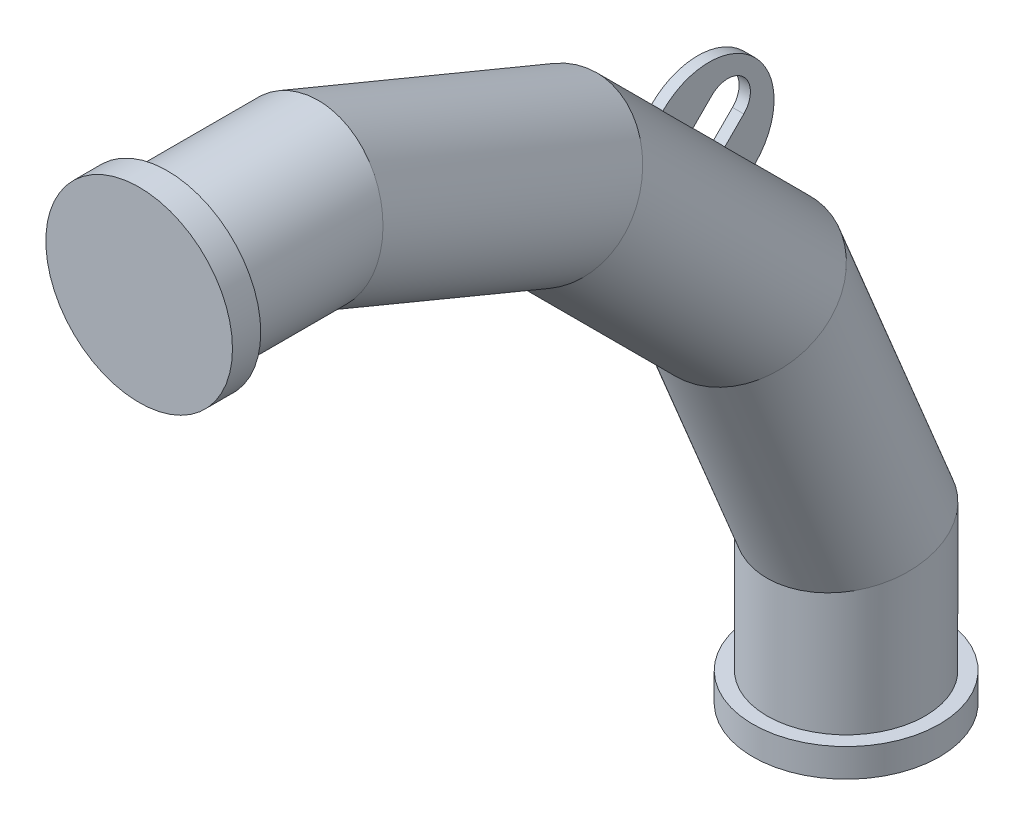
ISO-10303-21;
HEADER;
FILE_DESCRIPTION(('STEP AP214'),'2;1');
FILE_NAME('part.step','',(''),(''),'','','');
FILE_SCHEMA(('AUTOMOTIVE_DESIGN { 1 0 10303 214 1 1 1 1 }'));
ENDSEC;
DATA;
#1=APPLICATION_CONTEXT('core data for automotive mechanical design processes');
#2=APPLICATION_PROTOCOL_DEFINITION('international standard','automotive_design',2000,#1);
#3=PRODUCT_CONTEXT('',#1,'mechanical');
#4=PRODUCT('Part','Part','',(#3));
#5=PRODUCT_RELATED_PRODUCT_CATEGORY('part','',(#4));
#6=PRODUCT_DEFINITION_FORMATION('','',#4);
#7=PRODUCT_DEFINITION_CONTEXT('part definition',#1,'design');
#8=PRODUCT_DEFINITION('design','',#6,#7);
#9=PRODUCT_DEFINITION_SHAPE('','',#8);
#10=(LENGTH_UNIT() NAMED_UNIT(*) SI_UNIT(.MILLI.,.METRE.));
#11=(NAMED_UNIT(*) PLANE_ANGLE_UNIT() SI_UNIT($,.RADIAN.));
#12=(NAMED_UNIT(*) SI_UNIT($,.STERADIAN.) SOLID_ANGLE_UNIT());
#13=UNCERTAINTY_MEASURE_WITH_UNIT(LENGTH_MEASURE(1.E-05),#10,'distance_accuracy_value','');
#14=(GEOMETRIC_REPRESENTATION_CONTEXT(3) GLOBAL_UNCERTAINTY_ASSIGNED_CONTEXT((#13)) GLOBAL_UNIT_ASSIGNED_CONTEXT((#10,
#11,#12)) REPRESENTATION_CONTEXT('',''));
#15=CARTESIAN_POINT('',(0.,0.,0.));
#16=DIRECTION('',(0.,0.,1.));
#17=DIRECTION('',(1.,0.,0.));
#18=AXIS2_PLACEMENT_3D('',#15,#16,#17);
#19=CARTESIAN_POINT('',(0.,0.,0.));
#20=DIRECTION('',(0.,0.,0.999999999999917));
#21=DIRECTION('',(1.00000000000005,0.,0.));
#22=AXIS2_PLACEMENT_3D('',#19,#20,#21);
#23=PLANE('',#22);
#24=CARTESIAN_POINT('',(0.,0.,0.));
#25=DIRECTION('',(0.,0.,0.999999999999917));
#26=DIRECTION('',(1.00000000000005,0.,0.));
#27=AXIS2_PLACEMENT_3D('',#24,#25,#26);
#28=CIRCLE('',#27,82.5);
#29=CARTESIAN_POINT('',(82.5000000000045,-8.3956889418988E-13,-2.91044771522028E-13));
#30=VERTEX_POINT('',#29);
#31=EDGE_CURVE('E20',#30,#30,#28,.T.);
#32=ORIENTED_EDGE('',*,*,#31,.T.);
#33=EDGE_LOOP('',(#32));
#34=FACE_BOUND('',#33,.T.);
#35=ADVANCED_FACE('F16',(#34),#23,.T.);
#36=CARTESIAN_POINT('',(-4.2632564145606E-11,1.59872115546023E-11,-24.9999999999986));
#37=DIRECTION('',(0.,0.,0.999999999999917));
#38=DIRECTION('',(1.00000000000005,0.,0.));
#39=AXIS2_PLACEMENT_3D('',#36,#37,#38);
#40=CYLINDRICAL_SURFACE('',#39,82.5);
#41=CARTESIAN_POINT('',(-4.2632564145606E-11,1.59872115546023E-11,-24.9999999999986));
#42=DIRECTION('',(0.,0.,0.999999999999917));
#43=DIRECTION('',(1.00000000000005,0.,0.));
#44=AXIS2_PLACEMENT_3D('',#41,#42,#43);
#45=CIRCLE('',#44,82.5);
#46=CARTESIAN_POINT('',(82.4999999999618,1.51476426604124E-11,-24.9999999999989));
#47=VERTEX_POINT('',#46);
#48=EDGE_CURVE('E27',#47,#47,#45,.T.);
#49=ORIENTED_EDGE('',*,*,#48,.T.);
#50=EDGE_LOOP('',(#49));
#51=FACE_BOUND('',#50,.T.);
#52=ORIENTED_EDGE('',*,*,#31,.F.);
#53=EDGE_LOOP('',(#52));
#54=FACE_BOUND('',#53,.T.);
#55=ADVANCED_FACE('F18',(#51,#54),#40,.T.);
#56=CARTESIAN_POINT('',(-4.2632564145606E-11,1.59872115546023E-11,-24.9999999999986));
#57=DIRECTION('',(0.,0.,0.999999999999917));
#58=DIRECTION('',(1.00000000000005,0.,0.));
#59=AXIS2_PLACEMENT_3D('',#56,#57,#58);
#60=PLANE('',#59);
#61=CARTESIAN_POINT('',(2.82424585789659E-13,-3.80894403837855E-13,-24.9999999999987));
#62=DIRECTION('',(0.,0.,-0.99999999999992));
#63=DIRECTION('',(0.,0.999999999999963,0.));
#64=AXIS2_PLACEMENT_3D('',#61,#62,#63);
#65=CIRCLE('',#64,69.85);
#66=CARTESIAN_POINT('',(8.83549409532471E-13,69.849999999997,-24.9999999999983));
#67=VERTEX_POINT('',#66);
#68=EDGE_CURVE('E10',#67,#67,#65,.T.);
#69=ORIENTED_EDGE('',*,*,#68,.F.);
#70=EDGE_LOOP('',(#69));
#71=FACE_BOUND('',#70,.T.);
#72=ORIENTED_EDGE('',*,*,#48,.F.);
#73=EDGE_LOOP('',(#72));
#74=FACE_BOUND('',#73,.T.);
#75=ADVANCED_FACE('F313',(#71,#74),#60,.F.);
#76=CARTESIAN_POINT('',(5.9977401324112E-12,-260.127301589902,-533.655439013424));
#77=DIRECTION('',(0.,0.707106781186513,0.707106781186446));
#78=DIRECTION('',(0.,-0.707106781186533,0.707106781186462));
#79=AXIS2_PLACEMENT_3D('',#76,#77,#78);
#80=CYLINDRICAL_SURFACE('',#79,69.85);
#81=CARTESIAN_POINT('',(4.01236839414371E-12,-189.878066911988,-463.406204335516));
#82=DIRECTION('',(0.,-0.707106781186528,-0.707106781186567));
#83=DIRECTION('',(0.,0.707106781186567,-0.707106781186528));
#84=AXIS2_PLACEMENT_3D('',#81,#82,#83);
#85=CIRCLE('',#84,69.85);
#86=CARTESIAN_POINT('',(-5.00000000000099,-140.613360985747,-512.670910261768));
#87=VERTEX_POINT('',#86);
#88=CARTESIAN_POINT('',(4.99999999999901,-140.613360985746,-512.670910261768));
#89=VERTEX_POINT('',#88);
#90=EDGE_CURVE('E287',#87,#89,#85,.T.);
#91=ORIENTED_EDGE('',*,*,#90,.F.);
#92=DIRECTION('',(0.,0.707106781186513,0.707106781186446));
#93=VECTOR('',#92,1.);
#94=CARTESIAN_POINT('',(-5.,-210.862595663658,-582.920144939672));
#95=LINE('',#94,#93);
#96=CARTESIAN_POINT('',(-5.,-167.129865280232,-539.18741455626));
#97=VERTEX_POINT('',#96);
#98=EDGE_CURVE('E280',#97,#87,#95,.T.);
#99=ORIENTED_EDGE('',*,*,#98,.F.);
#100=CARTESIAN_POINT('',(4.76177325905526E-12,-216.394571206485,-489.922708630011));
#101=DIRECTION('',(0.,0.707106781186528,0.707106781186567));
#102=DIRECTION('',(0.,-0.707106781186567,0.707106781186528));
#103=AXIS2_PLACEMENT_3D('',#100,#101,#102);
#104=CIRCLE('',#103,69.85);
#105=CARTESIAN_POINT('',(5.,-167.129865280232,-539.187414556261));
#106=VERTEX_POINT('',#105);
#107=EDGE_CURVE('E276',#106,#97,#104,.T.);
#108=ORIENTED_EDGE('',*,*,#107,.F.);
#109=DIRECTION('',(0.,0.707106781186513,0.707106781186446));
#110=VECTOR('',#109,1.);
#111=CARTESIAN_POINT('',(5.,-210.862595663658,-582.920144939673));
#112=LINE('',#111,#110);
#113=EDGE_CURVE('E284',#106,#89,#112,.T.);
#114=ORIENTED_EDGE('',*,*,#113,.T.);
#115=EDGE_LOOP('',(#91,#99,#108,#114));
#116=FACE_BOUND('',#115,.T.);
#117=CARTESIAN_POINT('',(-3.52762477943871E-12,-260.127301589742,-533.655439013625));
#118=DIRECTION('',(0.,0.831469612302445,0.555570233019576));
#119=DIRECTION('',(0.,-0.555570233019497,0.8314696123025));
#120=AXIS2_PLACEMENT_3D('',#117,#118,#119);
#121=ELLIPSE('',#120,71.218442400851,69.85);
#122=CARTESIAN_POINT('',(-2.74032078247067E-12,-299.694148229668,-474.439468321801));
#123=VERTEX_POINT('',#122);
#124=EDGE_CURVE('E265',#123,#123,#121,.T.);
#125=ORIENTED_EDGE('',*,*,#124,.T.);
#126=EDGE_LOOP('',(#125));
#127=FACE_BOUND('',#126,.T.);
#128=CARTESIAN_POINT('',(-7.7047274067435E-11,-91.3445609866423,-364.872698410153));
#129=DIRECTION('',(0.,0.555570233019575,0.831469612302437));
#130=DIRECTION('',(0.,0.831469612302526,-0.555570233019533));
#131=AXIS2_PLACEMENT_3D('',#128,#129,#130);
#132=ELLIPSE('',#131,71.218442400851,69.85);
#133=CARTESIAN_POINT('',(-7.68251839981912E-11,-32.128590294817,-404.439545050082));
#134=VERTEX_POINT('',#133);
#135=EDGE_CURVE('E261',#134,#134,#132,.T.);
#136=ORIENTED_EDGE('',*,*,#135,.F.);
#137=EDGE_LOOP('',(#136));
#138=FACE_BOUND('',#137,.T.);
#139=CARTESIAN_POINT('',(3.21300320490472E-12,-161.593795664524,-435.121933088056));
#140=DIRECTION('',(0.,0.707106781186528,0.707106781186567));
#141=DIRECTION('',(0.,-0.707106781186567,0.707106781186528));
#142=AXIS2_PLACEMENT_3D('',#139,#140,#141);
#143=CIRCLE('',#142,69.85);
#144=CARTESIAN_POINT('',(4.99999999999861,-112.329089738286,-484.38663901431));
#145=VERTEX_POINT('',#144);
#146=CARTESIAN_POINT('',(-5.00000000000139,-112.329089738286,-484.38663901431));
#147=VERTEX_POINT('',#146);
#148=EDGE_CURVE('E40',#145,#147,#143,.T.);
#149=ORIENTED_EDGE('',*,*,#148,.F.);
#150=CARTESIAN_POINT('',(5.,-85.812585443775,-457.870134719811));
#151=VERTEX_POINT('',#150);
#152=EDGE_CURVE('E288',#145,#151,#112,.T.);
#153=ORIENTED_EDGE('',*,*,#152,.T.);
#154=CARTESIAN_POINT('',(2.46359833999317E-12,-135.077291370028,-408.605428793562));
#155=DIRECTION('',(0.,-0.707106781186528,-0.707106781186567));
#156=DIRECTION('',(0.,0.707106781186567,-0.707106781186528));
#157=AXIS2_PLACEMENT_3D('',#154,#155,#156);
#158=CIRCLE('',#157,69.85);
#159=CARTESIAN_POINT('',(-5.,-85.8125854437753,-457.870134719811));
#160=VERTEX_POINT('',#159);
#161=EDGE_CURVE('E292',#160,#151,#158,.T.);
#162=ORIENTED_EDGE('',*,*,#161,.F.);
#163=EDGE_CURVE('E49',#147,#160,#95,.T.);
#164=ORIENTED_EDGE('',*,*,#163,.F.);
#165=EDGE_LOOP('',(#149,#153,#162,#164));
#166=FACE_BOUND('',#165,.T.);
#167=ADVANCED_FACE('F319',(#116,#127,#138,#166),#80,.T.);
#168=CARTESIAN_POINT('',(8.79509533044249E-11,-480.65257957233,-625.000000000124));
#169=DIRECTION('',(0.,-0.99999999999992,0.));
#170=DIRECTION('',(0.,0.,0.999999999999963));
#171=AXIS2_PLACEMENT_3D('',#168,#169,#170);
#172=CYLINDRICAL_SURFACE('',#171,69.85);
#173=CARTESIAN_POINT('',(3.13609077507339E-12,-600.000000000038,-625.000000000063));
#174=DIRECTION('',(0.,0.99999999999992,0.));
#175=DIRECTION('',(0.,0.,-0.999999999999963));
#176=AXIS2_PLACEMENT_3D('',#173,#174,#175);
#177=CIRCLE('',#176,69.85);
#178=CARTESIAN_POINT('',(2.52333358959007E-12,-600.000000000039,-694.85000000006));
#179=VERTEX_POINT('',#178);
#180=EDGE_CURVE('E253',#179,#179,#177,.T.);
#181=ORIENTED_EDGE('',*,*,#180,.T.);
#182=EDGE_LOOP('',(#181));
#183=FACE_BOUND('',#182,.T.);
#184=CARTESIAN_POINT('',(8.79509533044249E-11,-480.65257957233,-625.000000000124));
#185=DIRECTION('',(0.,0.980785280403154,0.195090322016123));
#186=DIRECTION('',(0.,-0.195090322016098,0.980785280403191));
#187=AXIS2_PLACEMENT_3D('',#184,#185,#186);
#188=ELLIPSE('',#187,71.218442400851,69.85);
#189=CARTESIAN_POINT('',(8.87704458832899E-11,-494.546608433797,-555.150000000127));
#190=VERTEX_POINT('',#189);
#191=EDGE_CURVE('E269',#190,#190,#188,.T.);
#192=ORIENTED_EDGE('',*,*,#191,.F.);
#193=EDGE_LOOP('',(#192));
#194=FACE_BOUND('',#193,.T.);
#195=ADVANCED_FACE('F325',(#183,#194),#172,.T.);
#196=CARTESIAN_POINT('',(-3.52762477943871E-12,-260.127301589742,-533.655439013625));
#197=DIRECTION('',(0.,-0.923879532511181,-0.382683432365094));
#198=DIRECTION('',(0.,-0.382683432365013,0.923879532511242));
#199=AXIS2_PLACEMENT_3D('',#196,#197,#198);
#200=CYLINDRICAL_SURFACE('',#199,69.85);
#201=ORIENTED_EDGE('',*,*,#124,.F.);
#202=EDGE_LOOP('',(#201));
#203=FACE_BOUND('',#202,.T.);
#204=ORIENTED_EDGE('',*,*,#191,.T.);
#205=EDGE_LOOP('',(#204));
#206=FACE_BOUND('',#205,.T.);
#207=ADVANCED_FACE('F328',(#203,#206),#200,.T.);
#208=CARTESIAN_POINT('',(6.9437627335406E-12,-91.3445609864393,-364.872698410294));
#209=DIRECTION('',(0.,0.382683432365097,0.923879532511179));
#210=DIRECTION('',(0.,-0.923879532511241,0.382683432365016));
#211=AXIS2_PLACEMENT_3D('',#208,#209,#210);
#212=CYLINDRICAL_SURFACE('',#211,69.85);
#213=ORIENTED_EDGE('',*,*,#135,.T.);
#214=EDGE_LOOP('',(#213));
#215=FACE_BOUND('',#214,.T.);
#216=CARTESIAN_POINT('',(-7.61009195084211E-11,2.75967258167161E-11,-144.347420427728));
#217=DIRECTION('',(0.,0.195090322016145,0.98078528040312));
#218=DIRECTION('',(0.,0.980785280403186,-0.195090322016072));
#219=AXIS2_PLACEMENT_3D('',#216,#217,#218);
#220=ELLIPSE('',#219,71.218442400851,69.85);
#221=CARTESIAN_POINT('',(-7.58808061480406E-11,69.8500000000244,-158.241449289193));
#222=VERTEX_POINT('',#221);
#223=EDGE_CURVE('E257',#222,#222,#220,.T.);
#224=ORIENTED_EDGE('',*,*,#223,.F.);
#225=EDGE_LOOP('',(#224));
#226=FACE_BOUND('',#225,.T.);
#227=ADVANCED_FACE('F332',(#215,#226),#212,.T.);
#228=CARTESIAN_POINT('',(-8.45386144955723E-11,6.04593273456207E-11,-144.347420427707));
#229=DIRECTION('',(0.,0.,0.99999999999992));
#230=DIRECTION('',(0.,-0.999999999999963,0.));
#231=AXIS2_PLACEMENT_3D('',#228,#229,#230);
#232=CYLINDRICAL_SURFACE('',#231,69.85);
#233=ORIENTED_EDGE('',*,*,#68,.T.);
#234=EDGE_LOOP('',(#233));
#235=FACE_BOUND('',#234,.T.);
#236=ORIENTED_EDGE('',*,*,#223,.T.);
#237=EDGE_LOOP('',(#236));
#238=FACE_BOUND('',#237,.T.);
#239=ADVANCED_FACE('F339',(#235,#238),#232,.T.);
#240=CARTESIAN_POINT('',(-7.80591425642357E-12,-625.000000000037,-625.000000000063));
#241=DIRECTION('',(0.,-0.999999999999917,0.));
#242=DIRECTION('',(1.00000000000005,0.,0.));
#243=AXIS2_PLACEMENT_3D('',#240,#241,#242);
#244=PLANE('',#243);
#245=CARTESIAN_POINT('',(-7.80591425642357E-12,-625.000000000037,-625.000000000063));
#246=DIRECTION('',(0.,-0.999999999999917,0.));
#247=DIRECTION('',(1.00000000000005,0.,0.));
#248=AXIS2_PLACEMENT_3D('',#245,#246,#247);
#249=CIRCLE('',#248,82.5);
#250=CARTESIAN_POINT('',(82.4999999999967,-625.000000000036,-625.000000000064));
#251=VERTEX_POINT('',#250);
#252=EDGE_CURVE('E248',#251,#251,#249,.T.);
#253=ORIENTED_EDGE('',*,*,#252,.T.);
#254=EDGE_LOOP('',(#253));
#255=FACE_BOUND('',#254,.T.);
#256=ADVANCED_FACE('F343',(#255),#244,.T.);
#257=CARTESIAN_POINT('',(-5.04378295749067E-11,-600.000000000038,-625.000000000047));
#258=DIRECTION('',(0.,-0.999999999999917,0.));
#259=DIRECTION('',(1.00000000000005,0.,0.));
#260=AXIS2_PLACEMENT_3D('',#257,#258,#259);
#261=CYLINDRICAL_SURFACE('',#260,82.5);
#262=CARTESIAN_POINT('',(-5.04378295749067E-11,-600.000000000038,-625.000000000047));
#263=DIRECTION('',(0.,-0.999999999999917,0.));
#264=DIRECTION('',(1.00000000000005,0.,0.));
#265=AXIS2_PLACEMENT_3D('',#262,#263,#264);
#266=CIRCLE('',#265,82.5);
#267=CARTESIAN_POINT('',(82.499999999954,-600.000000000038,-625.000000000048));
#268=VERTEX_POINT('',#267);
#269=EDGE_CURVE('E249',#268,#268,#266,.T.);
#270=ORIENTED_EDGE('',*,*,#269,.T.);
#271=EDGE_LOOP('',(#270));
#272=FACE_BOUND('',#271,.T.);
#273=ORIENTED_EDGE('',*,*,#252,.F.);
#274=EDGE_LOOP('',(#273));
#275=FACE_BOUND('',#274,.T.);
#276=ADVANCED_FACE('F345',(#272,#275),#261,.T.);
#277=CARTESIAN_POINT('',(-5.04378295749067E-11,-600.000000000038,-625.000000000047));
#278=DIRECTION('',(0.,-0.999999999999917,0.));
#279=DIRECTION('',(1.00000000000005,0.,0.));
#280=AXIS2_PLACEMENT_3D('',#277,#278,#279);
#281=PLANE('',#280);
#282=ORIENTED_EDGE('',*,*,#180,.F.);
#283=EDGE_LOOP('',(#282));
#284=FACE_BOUND('',#283,.T.);
#285=ORIENTED_EDGE('',*,*,#269,.F.);
#286=EDGE_LOOP('',(#285));
#287=FACE_BOUND('',#286,.T.);
#288=ADVANCED_FACE('F348',(#284,#287),#281,.F.);
#289=CARTESIAN_POINT('',(5.,-109.621447247133,-515.378552752905));
#290=DIRECTION('',(1.,0.,0.));
#291=DIRECTION('',(0.,0.707106781186567,-0.707106781186528));
#292=AXIS2_PLACEMENT_3D('',#289,#290,#291);
#293=PLANE('',#292);
#294=ORIENTED_EDGE('',*,*,#113,.F.);
#295=DIRECTION('',(0.,0.707106781186567,-0.707106781186528));
#296=VECTOR('',#295,1.);
#297=CARTESIAN_POINT('',(5.,-173.968164335108,-532.349115501384));
#298=LINE('',#297,#296);
#299=CARTESIAN_POINT('',(5.,-166.897096523243,-539.42018331325));
#300=VERTEX_POINT('',#299);
#301=EDGE_CURVE('E185',#106,#300,#298,.T.);
#302=ORIENTED_EDGE('',*,*,#301,.T.);
#303=CARTESIAN_POINT('',(5.,-126.238456605017,-498.761543395022));
#304=DIRECTION('',(1.,0.,0.));
#305=DIRECTION('',(0.,0.707106781186567,-0.707106781186528));
#306=AXIS2_PLACEMENT_3D('',#303,#304,#305);
#307=CIRCLE('',#306,57.5);
#308=CARTESIAN_POINT('',(5.,-85.5798166867919,-458.102903476794));
#309=VERTEX_POINT('',#308);
#310=EDGE_CURVE('E216',#300,#309,#307,.T.);
#311=ORIENTED_EDGE('',*,*,#310,.T.);
#312=DIRECTION('',(0.,0.707106781186567,-0.707106781186528));
#313=VECTOR('',#312,1.);
#314=CARTESIAN_POINT('',(5.,-92.6508844986576,-451.031835664929));
#315=LINE('',#314,#313);
#316=EDGE_CURVE('E198',#151,#309,#315,.T.);
#317=ORIENTED_EDGE('',*,*,#316,.F.);
#318=ORIENTED_EDGE('',*,*,#152,.F.);
#319=DIRECTION('',(0.,0.707106781186567,-0.707106781186528));
#320=VECTOR('',#319,1.);
#321=CARTESIAN_POINT('',(5.,-112.096320981287,-484.619407771291));
#322=LINE('',#321,#320);
#323=CARTESIAN_POINT('',(5.,-95.4793116234023,-501.236417129174));
#324=VERTEX_POINT('',#323);
#325=EDGE_CURVE('E205',#145,#324,#322,.T.);
#326=ORIENTED_EDGE('',*,*,#325,.T.);
#327=CARTESIAN_POINT('',(5.,-109.621447247133,-515.378552752905));
#328=DIRECTION('',(-1.,0.,0.));
#329=DIRECTION('',(0.,0.707106781186567,-0.707106781186528));
#330=AXIS2_PLACEMENT_3D('',#327,#328,#329);
#331=CIRCLE('',#330,20.);
#332=CARTESIAN_POINT('',(5.,-123.763582870863,-529.520688376637));
#333=VERTEX_POINT('',#332);
#334=EDGE_CURVE('E208',#324,#333,#331,.T.);
#335=ORIENTED_EDGE('',*,*,#334,.T.);
#336=DIRECTION('',(0.,-0.707106781186567,0.707106781186528));
#337=VECTOR('',#336,1.);
#338=CARTESIAN_POINT('',(5.,-140.380592228748,-512.903679018753));
#339=LINE('',#338,#337);
#340=EDGE_CURVE('E212',#333,#89,#339,.T.);
#341=ORIENTED_EDGE('',*,*,#340,.T.);
#342=EDGE_LOOP('',(#294,#302,#311,#317,#318,#326,#335,#341));
#343=FACE_BOUND('',#342,.T.);
#344=ADVANCED_FACE('F355',(#343),#293,.T.);
#345=CARTESIAN_POINT('',(-5.,-109.621447247133,-515.378552752905));
#346=DIRECTION('',(1.,0.,0.));
#347=DIRECTION('',(0.,0.707106781186567,-0.707106781186528));
#348=AXIS2_PLACEMENT_3D('',#345,#346,#347);
#349=PLANE('',#348);
#350=DIRECTION('',(0.,0.707106781186567,-0.707106781186528));
#351=VECTOR('',#350,1.);
#352=CARTESIAN_POINT('',(-5.,-173.968164335108,-532.349115501384));
#353=LINE('',#352,#351);
#354=CARTESIAN_POINT('',(-5.,-166.897096523243,-539.42018331325));
#355=VERTEX_POINT('',#354);
#356=EDGE_CURVE('E195',#97,#355,#353,.T.);
#357=ORIENTED_EDGE('',*,*,#356,.F.);
#358=ORIENTED_EDGE('',*,*,#98,.T.);
#359=DIRECTION('',(0.,-0.707106781186567,0.707106781186528));
#360=VECTOR('',#359,1.);
#361=CARTESIAN_POINT('',(-5.,-140.380592228748,-512.903679018753));
#362=LINE('',#361,#360);
#363=CARTESIAN_POINT('',(-5.,-123.763582870863,-529.520688376637));
#364=VERTEX_POINT('',#363);
#365=EDGE_CURVE('E226',#364,#87,#362,.T.);
#366=ORIENTED_EDGE('',*,*,#365,.F.);
#367=CARTESIAN_POINT('',(-5.,-109.621447247133,-515.378552752905));
#368=DIRECTION('',(-1.,0.,0.));
#369=DIRECTION('',(0.,0.707106781186567,-0.707106781186528));
#370=AXIS2_PLACEMENT_3D('',#367,#368,#369);
#371=CIRCLE('',#370,20.);
#372=CARTESIAN_POINT('',(-5.,-95.4793116234023,-501.236417129174));
#373=VERTEX_POINT('',#372);
#374=EDGE_CURVE('E223',#373,#364,#371,.T.);
#375=ORIENTED_EDGE('',*,*,#374,.F.);
#376=DIRECTION('',(0.,0.707106781186567,-0.707106781186528));
#377=VECTOR('',#376,1.);
#378=CARTESIAN_POINT('',(-5.,-112.096320981287,-484.619407771291));
#379=LINE('',#378,#377);
#380=EDGE_CURVE('E204',#147,#373,#379,.T.);
#381=ORIENTED_EDGE('',*,*,#380,.F.);
#382=ORIENTED_EDGE('',*,*,#163,.T.);
#383=DIRECTION('',(0.,0.707106781186567,-0.707106781186528));
#384=VECTOR('',#383,1.);
#385=CARTESIAN_POINT('',(-5.,-92.6508844986576,-451.031835664929));
#386=LINE('',#385,#384);
#387=CARTESIAN_POINT('',(-5.,-85.5798166867919,-458.102903476794));
#388=VERTEX_POINT('',#387);
#389=EDGE_CURVE('E201',#160,#388,#386,.T.);
#390=ORIENTED_EDGE('',*,*,#389,.T.);
#391=CARTESIAN_POINT('',(-5.,-126.238456605017,-498.761543395022));
#392=DIRECTION('',(1.,0.,0.));
#393=DIRECTION('',(0.,0.707106781186567,-0.707106781186528));
#394=AXIS2_PLACEMENT_3D('',#391,#392,#393);
#395=CIRCLE('',#394,57.5);
#396=EDGE_CURVE('E209',#355,#388,#395,.T.);
#397=ORIENTED_EDGE('',*,*,#396,.F.);
#398=EDGE_LOOP('',(#357,#358,#366,#375,#381,#382,#390,#397));
#399=FACE_BOUND('',#398,.T.);
#400=ADVANCED_FACE('F361',(#399),#349,.F.);
#401=CARTESIAN_POINT('',(5.,-112.096320981287,-484.619407771291));
#402=DIRECTION('',(0.,0.707106781186528,0.707106781186567));
#403=DIRECTION('',(0.,-0.707106781186567,0.707106781186528));
#404=AXIS2_PLACEMENT_3D('',#401,#402,#403);
#405=PLANE('',#404);
#406=ORIENTED_EDGE('',*,*,#325,.F.);
#407=ORIENTED_EDGE('',*,*,#148,.T.);
#408=ORIENTED_EDGE('',*,*,#380,.T.);
#409=DIRECTION('',(-1.,0.,0.));
#410=VECTOR('',#409,1.);
#411=CARTESIAN_POINT('',(5.,-95.4793116234023,-501.236417129174));
#412=LINE('',#411,#410);
#413=EDGE_CURVE('E244',#324,#373,#412,.T.);
#414=ORIENTED_EDGE('',*,*,#413,.F.);
#415=EDGE_LOOP('',(#406,#407,#408,#414));
#416=FACE_BOUND('',#415,.T.);
#417=ADVANCED_FACE('F357',(#416),#405,.F.);
#418=CARTESIAN_POINT('',(5.,-109.621447247133,-515.378552752905));
#419=DIRECTION('',(-1.,0.,0.));
#420=DIRECTION('',(0.,-0.707106781186567,0.707106781186528));
#421=AXIS2_PLACEMENT_3D('',#418,#419,#420);
#422=CYLINDRICAL_SURFACE('',#421,20.);
#423=ORIENTED_EDGE('',*,*,#374,.T.);
#424=DIRECTION('',(-1.,0.,0.));
#425=VECTOR('',#424,1.);
#426=CARTESIAN_POINT('',(5.,-123.763582870863,-529.520688376637));
#427=LINE('',#426,#425);
#428=EDGE_CURVE('E240',#333,#364,#427,.T.);
#429=ORIENTED_EDGE('',*,*,#428,.F.);
#430=ORIENTED_EDGE('',*,*,#334,.F.);
#431=ORIENTED_EDGE('',*,*,#413,.T.);
#432=EDGE_LOOP('',(#423,#429,#430,#431));
#433=FACE_BOUND('',#432,.T.);
#434=ADVANCED_FACE('F360',(#433),#422,.F.);
#435=CARTESIAN_POINT('',(5.,-140.380592228748,-512.903679018753));
#436=DIRECTION('',(0.,-0.707106781186528,-0.707106781186567));
#437=DIRECTION('',(0.,0.707106781186567,-0.707106781186528));
#438=AXIS2_PLACEMENT_3D('',#435,#436,#437);
#439=PLANE('',#438);
#440=ORIENTED_EDGE('',*,*,#365,.T.);
#441=ORIENTED_EDGE('',*,*,#90,.T.);
#442=ORIENTED_EDGE('',*,*,#340,.F.);
#443=ORIENTED_EDGE('',*,*,#428,.T.);
#444=EDGE_LOOP('',(#440,#441,#442,#443));
#445=FACE_BOUND('',#444,.T.);
#446=ADVANCED_FACE('F365',(#445),#439,.F.);
#447=CARTESIAN_POINT('',(5.,-126.238456605017,-498.761543395022));
#448=DIRECTION('',(-1.,0.,0.));
#449=DIRECTION('',(0.,-0.707106781186567,0.707106781186528));
#450=AXIS2_PLACEMENT_3D('',#447,#448,#449);
#451=CYLINDRICAL_SURFACE('',#450,57.5);
#452=ORIENTED_EDGE('',*,*,#396,.T.);
#453=DIRECTION('',(-1.,0.,0.));
#454=VECTOR('',#453,1.);
#455=CARTESIAN_POINT('',(5.,-85.5798166867919,-458.102903476794));
#456=LINE('',#455,#454);
#457=EDGE_CURVE('E220',#309,#388,#456,.T.);
#458=ORIENTED_EDGE('',*,*,#457,.F.);
#459=ORIENTED_EDGE('',*,*,#310,.F.);
#460=DIRECTION('',(-1.,0.,0.));
#461=VECTOR('',#460,1.);
#462=CARTESIAN_POINT('',(5.,-166.897096523243,-539.42018331325));
#463=LINE('',#462,#461);
#464=EDGE_CURVE('E236',#300,#355,#463,.T.);
#465=ORIENTED_EDGE('',*,*,#464,.T.);
#466=EDGE_LOOP('',(#452,#458,#459,#465));
#467=FACE_BOUND('',#466,.T.);
#468=ADVANCED_FACE('F369',(#467),#451,.T.);
#469=CARTESIAN_POINT('',(5.,-92.6508844986576,-451.031835664929));
#470=DIRECTION('',(0.,-0.707106781186528,-0.707106781186567));
#471=DIRECTION('',(0.,0.707106781186567,-0.707106781186528));
#472=AXIS2_PLACEMENT_3D('',#469,#470,#471);
#473=PLANE('',#472);
#474=ORIENTED_EDGE('',*,*,#389,.F.);
#475=ORIENTED_EDGE('',*,*,#161,.T.);
#476=ORIENTED_EDGE('',*,*,#316,.T.);
#477=ORIENTED_EDGE('',*,*,#457,.T.);
#478=EDGE_LOOP('',(#474,#475,#476,#477));
#479=FACE_BOUND('',#478,.T.);
#480=ADVANCED_FACE('F373',(#479),#473,.F.);
#481=CARTESIAN_POINT('',(-5.,-173.968164335108,-532.349115501384));
#482=DIRECTION('',(0.,0.707106781186528,0.707106781186567));
#483=DIRECTION('',(0.,-0.707106781186567,0.707106781186528));
#484=AXIS2_PLACEMENT_3D('',#481,#482,#483);
#485=PLANE('',#484);
#486=ORIENTED_EDGE('',*,*,#301,.F.);
#487=ORIENTED_EDGE('',*,*,#107,.T.);
#488=ORIENTED_EDGE('',*,*,#356,.T.);
#489=ORIENTED_EDGE('',*,*,#464,.F.);
#490=EDGE_LOOP('',(#486,#487,#488,#489));
#491=FACE_BOUND('',#490,.T.);
#492=ADVANCED_FACE('F383',(#491),#485,.F.);
#493=CLOSED_SHELL('',(#35,#55,#75,#167,#195,#207,#227,#239,#256,#276,#288,#344,#400,#417,#434,
#446,#468,#480,#492));
#494=CARTESIAN_POINT('',(0.,0.,-25.));
#495=DIRECTION('',(0.,0.,1.));
#496=DIRECTION('',(1.,0.,0.));
#497=AXIS2_PLACEMENT_3D('',#494,#495,#496);
#498=PLANE('',#497);
#499=CARTESIAN_POINT('',(0.,0.,-25.));
#500=DIRECTION('',(0.,0.,-0.999999999999915));
#501=DIRECTION('',(0.,0.999999999999973,0.));
#502=AXIS2_PLACEMENT_3D('',#499,#500,#501);
#503=CIRCLE('',#502,27.);
#504=CARTESIAN_POINT('',(-1.91320176863476E-12,26.9999999998722,-24.9999999999968));
#505=VERTEX_POINT('',#504);
#506=EDGE_CURVE('E186',#505,#505,#503,.T.);
#507=ORIENTED_EDGE('',*,*,#506,.T.);
#508=EDGE_LOOP('',(#507));
#509=FACE_BOUND('',#508,.T.);
#510=ADVANCED_FACE('F392',(#509),#498,.F.);
#511=CARTESIAN_POINT('',(4.25155948587603E-11,-600.000000000128,-25.000000000072));
#512=DIRECTION('',(1.00000000000016,0.,0.));
#513=DIRECTION('',(0.,-0.999999999999915,0.));
#514=AXIS2_PLACEMENT_3D('',#511,#512,#513);
#515=TOROIDAL_SURFACE('',#514,600.,27.);
#516=CARTESIAN_POINT('',(0.,-600.000000000038,-625.000000000063));
#517=DIRECTION('',(0.,0.999999999999915,0.));
#518=DIRECTION('',(0.,0.,-0.999999999999973));
#519=AXIS2_PLACEMENT_3D('',#516,#517,#518);
#520=CIRCLE('',#519,27.);
#521=CARTESIAN_POINT('',(-1.88369315257443E-12,-600.000000000034,-652.000000000072));
#522=VERTEX_POINT('',#521);
#523=EDGE_CURVE('E180',#522,#522,#520,.T.);
#524=CARTESIAN_POINT('',(4.25155948587603E-11,-600.000000000128,-25.000000000072));
#525=DIRECTION('',(1.00000000000016,0.,0.));
#526=DIRECTION('',(0.,-0.999999999999915,0.));
#527=AXIS2_PLACEMENT_3D('',#524,#525,#526);
#528=CIRCLE('',#527,627.);
#529=EDGE_CURVE('',#522,#505,#528,.T.);
#530=ORIENTED_EDGE('',*,*,#523,.F.);
#531=ORIENTED_EDGE('',*,*,#506,.F.);
#532=ORIENTED_EDGE('',*,*,#529,.T.);
#533=ORIENTED_EDGE('',*,*,#529,.F.);
#534=EDGE_LOOP('',(#530,#532,#531,#533));
#535=FACE_BOUND('',#534,.T.);
#536=ADVANCED_FACE('F388',(#535),#515,.F.);
#537=CARTESIAN_POINT('',(-5.04378295749067E-11,-600.000000000038,-625.000000000047));
#538=DIRECTION('',(0.,-0.999999999999917,0.));
#539=DIRECTION('',(1.00000000000005,0.,0.));
#540=AXIS2_PLACEMENT_3D('',#537,#538,#539);
#541=CYLINDRICAL_SURFACE('',#540,27.);
#542=CARTESIAN_POINT('',(-5.05089049448528E-11,-620.000000000034,-625.000000000047));
#543=DIRECTION('',(0.,0.999999999999917,0.));
#544=DIRECTION('',(0.,0.,1.));
#545=AXIS2_PLACEMENT_3D('',#542,#543,#544);
#546=CIRCLE('',#545,27.);
#547=CARTESIAN_POINT('',(-5.05089049448528E-11,-620.000000000035,-598.000000000047));
#548=VERTEX_POINT('',#547);
#549=EDGE_CURVE('E181',#548,#548,#546,.F.);
#550=ORIENTED_EDGE('',*,*,#549,.T.);
#551=EDGE_LOOP('',(#550));
#552=FACE_BOUND('',#551,.T.);
#553=ORIENTED_EDGE('',*,*,#523,.T.);
#554=EDGE_LOOP('',(#553));
#555=FACE_BOUND('',#554,.T.);
#556=ADVANCED_FACE('F391',(#552,#555),#541,.F.);
#557=CARTESIAN_POINT('',(-9.83999833004118E-11,-620.000000000034,-625.000000000093));
#558=DIRECTION('',(0.,0.999999999999917,0.));
#559=DIRECTION('',(-1.00000000000005,0.,0.));
#560=AXIS2_PLACEMENT_3D('',#557,#558,#559);
#561=PLANE('',#560);
#562=ORIENTED_EDGE('',*,*,#549,.F.);
#563=EDGE_LOOP('',(#562));
#564=FACE_BOUND('',#563,.T.);
#565=ADVANCED_FACE('F397',(#564),#561,.T.);
#566=CLOSED_SHELL('',(#510,#536,#556,#565));
#567=CARTESIAN_POINT('',(44.1941738241168,44.1941738241747,-20.0000000000049));
#568=DIRECTION('',(0.,0.,0.999999999999917));
#569=DIRECTION('',(0.,-1.,0.));
#570=AXIS2_PLACEMENT_3D('',#567,#568,#569);
#571=PLANE('',#570);
#572=CARTESIAN_POINT('',(44.1941738241168,44.1941738241747,-20.0000000000049));
#573=DIRECTION('',(0.,0.,0.999999999999917));
#574=DIRECTION('',(1.00000000000005,0.,0.));
#575=AXIS2_PLACEMENT_3D('',#572,#573,#574);
#576=CIRCLE('',#575,7.);
#577=CARTESIAN_POINT('',(51.1941738241172,44.1941738241746,-20.0000000000049));
#578=VERTEX_POINT('',#577);
#579=EDGE_CURVE('E165',#578,#578,#576,.T.);
#580=ORIENTED_EDGE('',*,*,#579,.F.);
#581=EDGE_LOOP('',(#580));
#582=FACE_BOUND('',#581,.T.);
#583=ADVANCED_FACE('F445',(#582),#571,.F.);
#584=CARTESIAN_POINT('',(44.1941738241168,44.1941738241747,-20.0000000000049));
#585=DIRECTION('',(0.,0.,0.999999999999917));
#586=DIRECTION('',(1.00000000000005,0.,0.));
#587=AXIS2_PLACEMENT_3D('',#584,#585,#586);
#588=CONICAL_SURFACE('',#587,7.,1.02974425867665);
#589=CARTESIAN_POINT('',(44.1941738241169,44.1941738241631,-24.2060243331874));
#590=VERTEX_POINT('',#589);
#591=VERTEX_LOOP('',#590);
#592=FACE_BOUND('',#591,.T.);
#593=ORIENTED_EDGE('',*,*,#579,.T.);
#594=EDGE_LOOP('',(#593));
#595=FACE_BOUND('',#594,.T.);
#596=ADVANCED_FACE('F448',(#592,#595),#588,.F.);
#597=CLOSED_SHELL('',(#583,#596));
#598=CARTESIAN_POINT('',(44.1941738240796,-44.1941738241276,-19.9999999999658));
#599=DIRECTION('',(0.,0.,0.999999999999917));
#600=DIRECTION('',(0.,-1.,0.));
#601=AXIS2_PLACEMENT_3D('',#598,#599,#600);
#602=PLANE('',#601);
#603=CARTESIAN_POINT('',(44.1941738240796,-44.1941738241276,-19.9999999999658));
#604=DIRECTION('',(0.,0.,0.999999999999917));
#605=DIRECTION('',(1.00000000000005,0.,0.));
#606=AXIS2_PLACEMENT_3D('',#603,#604,#605);
#607=CIRCLE('',#606,7.);
#608=CARTESIAN_POINT('',(51.19417382408,-44.1941738241277,-19.9999999999658));
#609=VERTEX_POINT('',#608);
#610=EDGE_CURVE('E170',#609,#609,#607,.T.);
#611=ORIENTED_EDGE('',*,*,#610,.F.);
#612=EDGE_LOOP('',(#611));
#613=FACE_BOUND('',#612,.T.);
#614=ADVANCED_FACE('F435',(#613),#602,.F.);
#615=CARTESIAN_POINT('',(44.1941738240796,-44.1941738241276,-19.9999999999658));
#616=DIRECTION('',(0.,0.,0.999999999999917));
#617=DIRECTION('',(1.00000000000005,0.,0.));
#618=AXIS2_PLACEMENT_3D('',#615,#616,#617);
#619=CONICAL_SURFACE('',#618,7.,1.02974425867665);
#620=CARTESIAN_POINT('',(44.1941738240388,-44.1941738241542,-24.2060243331466));
#621=VERTEX_POINT('',#620);
#622=VERTEX_LOOP('',#621);
#623=FACE_BOUND('',#622,.T.);
#624=ORIENTED_EDGE('',*,*,#610,.T.);
#625=EDGE_LOOP('',(#624));
#626=FACE_BOUND('',#625,.T.);
#627=ADVANCED_FACE('F438',(#623,#626),#619,.F.);
#628=CLOSED_SHELL('',(#614,#627));
#629=CARTESIAN_POINT('',(-44.1941738242395,-44.1941738240255,-19.9999999999934));
#630=DIRECTION('',(0.,0.,0.999999999999917));
#631=DIRECTION('',(0.,-1.,0.));
#632=AXIS2_PLACEMENT_3D('',#629,#630,#631);
#633=PLANE('',#632);
#634=CARTESIAN_POINT('',(-44.1941738242395,-44.1941738240255,-19.9999999999934));
#635=DIRECTION('',(0.,0.,0.999999999999917));
#636=DIRECTION('',(1.00000000000005,0.,0.));
#637=AXIS2_PLACEMENT_3D('',#634,#635,#636);
#638=CIRCLE('',#637,6.99999999999999);
#639=CARTESIAN_POINT('',(-37.1941738242391,-44.1941738240255,-19.9999999999934));
#640=VERTEX_POINT('',#639);
#641=EDGE_CURVE('E156',#640,#640,#638,.T.);
#642=ORIENTED_EDGE('',*,*,#641,.F.);
#643=EDGE_LOOP('',(#642));
#644=FACE_BOUND('',#643,.T.);
#645=ADVANCED_FACE('F425',(#644),#633,.F.);
#646=CARTESIAN_POINT('',(-44.1941738242395,-44.1941738240255,-19.9999999999934));
#647=DIRECTION('',(0.,0.,0.999999999999917));
#648=DIRECTION('',(1.00000000000005,0.,0.));
#649=AXIS2_PLACEMENT_3D('',#646,#647,#648);
#650=CONICAL_SURFACE('',#649,6.99999999999999,1.02974425867665);
#651=CARTESIAN_POINT('',(-44.1941738242804,-44.1941738240237,-24.2060243331901));
#652=VERTEX_POINT('',#651);
#653=VERTEX_LOOP('',#652);
#654=FACE_BOUND('',#653,.T.);
#655=ORIENTED_EDGE('',*,*,#641,.T.);
#656=EDGE_LOOP('',(#655));
#657=FACE_BOUND('',#656,.T.);
#658=ADVANCED_FACE('F428',(#654,#657),#650,.F.);
#659=CLOSED_SHELL('',(#645,#658));
#660=CARTESIAN_POINT('',(-44.1941738242101,-605.000000000001,-580.805826175771));
#661=DIRECTION('',(0.,-0.999999999999917,0.));
#662=DIRECTION('',(0.,0.,-1.));
#663=AXIS2_PLACEMENT_3D('',#660,#661,#662);
#664=PLANE('',#663);
#665=CARTESIAN_POINT('',(-44.1941738242101,-605.000000000001,-580.805826175771));
#666=DIRECTION('',(0.,-0.999999999999917,0.));
#667=DIRECTION('',(1.00000000000005,0.,0.));
#668=AXIS2_PLACEMENT_3D('',#665,#666,#667);
#669=CIRCLE('',#668,7.);
#670=CARTESIAN_POINT('',(-37.1941738242097,-605.000000000001,-580.805826175771));
#671=VERTEX_POINT('',#670);
#672=EDGE_CURVE('E147',#671,#671,#669,.T.);
#673=ORIENTED_EDGE('',*,*,#672,.F.);
#674=EDGE_LOOP('',(#673));
#675=FACE_BOUND('',#674,.T.);
#676=ADVANCED_FACE('F415',(#675),#664,.F.);
#677=CARTESIAN_POINT('',(-44.1941738242101,-605.000000000001,-580.805826175771));
#678=DIRECTION('',(0.,-0.999999999999917,0.));
#679=DIRECTION('',(1.00000000000005,0.,0.));
#680=AXIS2_PLACEMENT_3D('',#677,#678,#679);
#681=CONICAL_SURFACE('',#680,7.,1.02974425867665);
#682=CARTESIAN_POINT('',(-44.19417382421,-600.793975666816,-580.805826175758));
#683=VERTEX_POINT('',#682);
#684=VERTEX_LOOP('',#683);
#685=FACE_BOUND('',#684,.T.);
#686=ORIENTED_EDGE('',*,*,#672,.T.);
#687=EDGE_LOOP('',(#686));
#688=FACE_BOUND('',#687,.T.);
#689=ADVANCED_FACE('F418',(#685,#688),#681,.F.);
#690=CLOSED_SHELL('',(#676,#689));
#691=CARTESIAN_POINT('',(44.194173824109,-605.000000000032,-580.805826175888));
#692=DIRECTION('',(0.,-0.999999999999917,0.));
#693=DIRECTION('',(0.,0.,-1.));
#694=AXIS2_PLACEMENT_3D('',#691,#692,#693);
#695=PLANE('',#694);
#696=CARTESIAN_POINT('',(44.194173824109,-605.000000000032,-580.805826175888));
#697=DIRECTION('',(0.,-0.999999999999917,0.));
#698=DIRECTION('',(1.00000000000005,0.,0.));
#699=AXIS2_PLACEMENT_3D('',#696,#697,#698);
#700=CIRCLE('',#699,7.);
#701=CARTESIAN_POINT('',(51.1941738241094,-605.000000000032,-580.805826175888));
#702=VERTEX_POINT('',#701);
#703=EDGE_CURVE('E144',#702,#702,#700,.T.);
#704=ORIENTED_EDGE('',*,*,#703,.F.);
#705=EDGE_LOOP('',(#704));
#706=FACE_BOUND('',#705,.T.);
#707=ADVANCED_FACE('F138',(#706),#695,.F.);
#708=CARTESIAN_POINT('',(44.194173824109,-605.000000000032,-580.805826175888));
#709=DIRECTION('',(0.,-0.999999999999917,0.));
#710=DIRECTION('',(1.00000000000005,0.,0.));
#711=AXIS2_PLACEMENT_3D('',#708,#709,#710);
#712=CONICAL_SURFACE('',#711,7.,1.02974425867665);
#713=CARTESIAN_POINT('',(44.1941738241091,-600.793975666849,-580.8058261759));
#714=VERTEX_POINT('',#713);
#715=VERTEX_LOOP('',#714);
#716=FACE_BOUND('',#715,.T.);
#717=ORIENTED_EDGE('',*,*,#703,.T.);
#718=EDGE_LOOP('',(#717));
#719=FACE_BOUND('',#718,.T.);
#720=ADVANCED_FACE('F135',(#716,#719),#712,.F.);
#721=CLOSED_SHELL('',(#707,#720));
#722=CARTESIAN_POINT('',(44.1941738240718,-605.000000000071,-669.19417382419));
#723=DIRECTION('',(0.,-0.999999999999917,0.));
#724=DIRECTION('',(0.,0.,-1.));
#725=AXIS2_PLACEMENT_3D('',#722,#723,#724);
#726=PLANE('',#725);
#727=CARTESIAN_POINT('',(44.1941738240718,-605.000000000071,-669.19417382419));
#728=DIRECTION('',(0.,-0.999999999999917,0.));
#729=DIRECTION('',(1.00000000000005,0.,0.));
#730=AXIS2_PLACEMENT_3D('',#727,#728,#729);
#731=CIRCLE('',#730,7.);
#732=CARTESIAN_POINT('',(51.1941738240722,-605.000000000071,-669.19417382419));
#733=VERTEX_POINT('',#732);
#734=EDGE_CURVE('E148',#733,#733,#731,.T.);
#735=ORIENTED_EDGE('',*,*,#734,.F.);
#736=EDGE_LOOP('',(#735));
#737=FACE_BOUND('',#736,.T.);
#738=ADVANCED_FACE('F465',(#737),#726,.F.);
#739=CARTESIAN_POINT('',(44.1941738240718,-605.000000000071,-669.19417382419));
#740=DIRECTION('',(0.,-0.999999999999917,0.));
#741=DIRECTION('',(1.00000000000005,0.,0.));
#742=AXIS2_PLACEMENT_3D('',#739,#740,#741);
#743=CONICAL_SURFACE('',#742,7.,1.02974425867665);
#744=CARTESIAN_POINT('',(44.194173824031,-600.79397566689,-669.194173824217));
#745=VERTEX_POINT('',#744);
#746=VERTEX_LOOP('',#745);
#747=FACE_BOUND('',#746,.T.);
#748=ORIENTED_EDGE('',*,*,#734,.T.);
#749=EDGE_LOOP('',(#748));
#750=FACE_BOUND('',#749,.T.);
#751=ADVANCED_FACE('F468',(#747,#750),#743,.F.);
#752=CLOSED_SHELL('',(#738,#751));
#753=CARTESIAN_POINT('',(-44.1941738242473,-605.000000000044,-669.194173824088));
#754=DIRECTION('',(0.,-0.999999999999917,0.));
#755=DIRECTION('',(0.,0.,-1.));
#756=AXIS2_PLACEMENT_3D('',#753,#754,#755);
#757=PLANE('',#756);
#758=CARTESIAN_POINT('',(-44.1941738242473,-605.000000000044,-669.194173824088));
#759=DIRECTION('',(0.,-0.999999999999917,0.));
#760=DIRECTION('',(1.00000000000005,0.,0.));
#761=AXIS2_PLACEMENT_3D('',#758,#759,#760);
#762=CIRCLE('',#761,6.99999999999999);
#763=CARTESIAN_POINT('',(-37.1941738242469,-605.000000000044,-669.194173824088));
#764=VERTEX_POINT('',#763);
#765=EDGE_CURVE('E159',#764,#764,#762,.T.);
#766=ORIENTED_EDGE('',*,*,#765,.F.);
#767=EDGE_LOOP('',(#766));
#768=FACE_BOUND('',#767,.T.);
#769=ADVANCED_FACE('F455',(#768),#757,.F.);
#770=CARTESIAN_POINT('',(-44.1941738242473,-605.000000000044,-669.194173824088));
#771=DIRECTION('',(0.,-0.999999999999917,0.));
#772=DIRECTION('',(1.00000000000005,0.,0.));
#773=AXIS2_PLACEMENT_3D('',#770,#771,#772);
#774=CONICAL_SURFACE('',#773,6.99999999999999,1.02974425867665);
#775=CARTESIAN_POINT('',(-44.1941738242882,-600.793975666847,-669.194173824086));
#776=VERTEX_POINT('',#775);
#777=VERTEX_LOOP('',#776);
#778=FACE_BOUND('',#777,.T.);
#779=ORIENTED_EDGE('',*,*,#765,.T.);
#780=EDGE_LOOP('',(#779));
#781=FACE_BOUND('',#780,.T.);
#782=ADVANCED_FACE('F458',(#778,#781),#774,.F.);
#783=CLOSED_SHELL('',(#769,#782));
#784=CARTESIAN_POINT('',(-44.1941738242023,44.1941738242919,-20.000000000036));
#785=DIRECTION('',(0.,0.,0.999999999999917));
#786=DIRECTION('',(0.,-1.,0.));
#787=AXIS2_PLACEMENT_3D('',#784,#785,#786);
#788=PLANE('',#787);
#789=CARTESIAN_POINT('',(-44.1941738242023,44.1941738242919,-20.000000000036));
#790=DIRECTION('',(0.,0.,0.999999999999917));
#791=DIRECTION('',(1.00000000000005,0.,0.));
#792=AXIS2_PLACEMENT_3D('',#789,#790,#791);
#793=CIRCLE('',#792,7.);
#794=CARTESIAN_POINT('',(-37.1941738242019,44.1941738242918,-20.000000000036));
#795=VERTEX_POINT('',#794);
#796=EDGE_CURVE('E169',#795,#795,#793,.T.);
#797=ORIENTED_EDGE('',*,*,#796,.F.);
#798=EDGE_LOOP('',(#797));
#799=FACE_BOUND('',#798,.T.);
#800=ADVANCED_FACE('F405',(#799),#788,.F.);
#801=CARTESIAN_POINT('',(-44.1941738242023,44.1941738242919,-20.000000000036));
#802=DIRECTION('',(0.,0.,0.999999999999917));
#803=DIRECTION('',(1.00000000000005,0.,0.));
#804=AXIS2_PLACEMENT_3D('',#801,#802,#803);
#805=CONICAL_SURFACE('',#804,7.,1.02974425867665);
#806=CARTESIAN_POINT('',(-44.1941738242022,44.1941738243044,-24.2060243332212));
#807=VERTEX_POINT('',#806);
#808=VERTEX_LOOP('',#807);
#809=FACE_BOUND('',#808,.T.);
#810=ORIENTED_EDGE('',*,*,#796,.T.);
#811=EDGE_LOOP('',(#810));
#812=FACE_BOUND('',#811,.T.);
#813=ADVANCED_FACE('F408',(#809,#812),#805,.F.);
#814=CLOSED_SHELL('',(#800,#813));
#815=ORIENTED_CLOSED_SHELL('',*,#566,.T.);
#816=ORIENTED_CLOSED_SHELL('',*,#597,.T.);
#817=ORIENTED_CLOSED_SHELL('',*,#628,.T.);
#818=ORIENTED_CLOSED_SHELL('',*,#659,.T.);
#819=ORIENTED_CLOSED_SHELL('',*,#690,.T.);
#820=ORIENTED_CLOSED_SHELL('',*,#721,.T.);
#821=ORIENTED_CLOSED_SHELL('',*,#752,.T.);
#822=ORIENTED_CLOSED_SHELL('',*,#783,.T.);
#823=ORIENTED_CLOSED_SHELL('',*,#814,.T.);
#824=BREP_WITH_VOIDS('B1',#493,(#815,#816,#817,#818,#819,#820,#821,#822,#823));
#825=ADVANCED_BREP_SHAPE_REPRESENTATION('',(#18,#824),#14);
#826=SHAPE_DEFINITION_REPRESENTATION(#9,#825);
ENDSEC;
END-ISO-10303-21;
